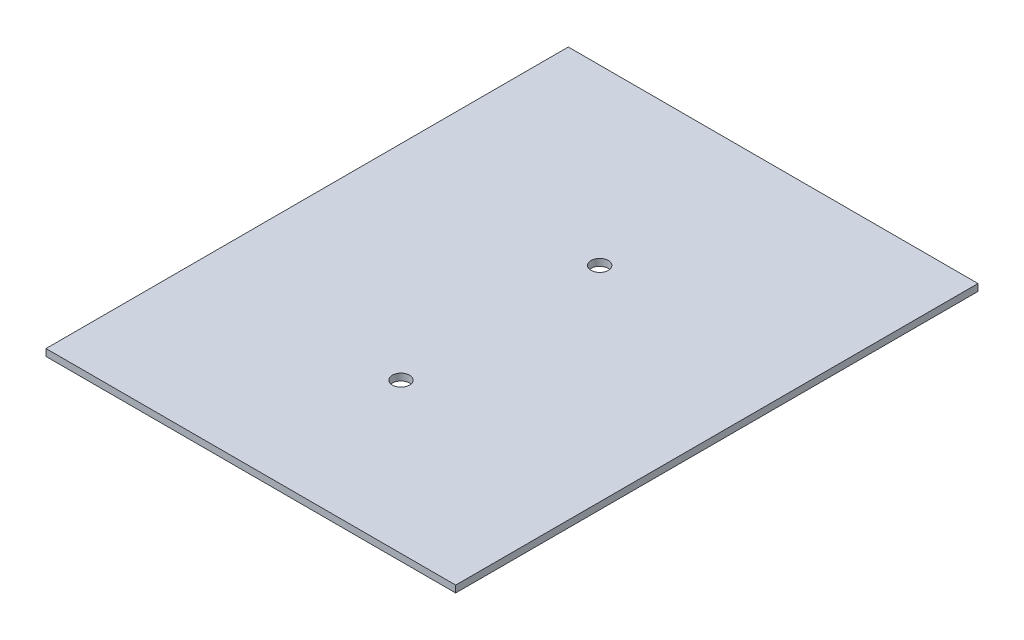
ISO-10303-21;
HEADER;
FILE_DESCRIPTION(('STEP AP214'),'2;1');
FILE_NAME('part.step','',(''),(''),'','','');
FILE_SCHEMA(('AUTOMOTIVE_DESIGN { 1 0 10303 214 1 1 1 1 }'));
ENDSEC;
DATA;
#1=APPLICATION_CONTEXT('core data for automotive mechanical design processes');
#2=APPLICATION_PROTOCOL_DEFINITION('international standard','automotive_design',2000,#1);
#3=PRODUCT_CONTEXT('',#1,'mechanical');
#4=PRODUCT('Part','Part','',(#3));
#5=PRODUCT_RELATED_PRODUCT_CATEGORY('part','',(#4));
#6=PRODUCT_DEFINITION_FORMATION('','',#4);
#7=PRODUCT_DEFINITION_CONTEXT('part definition',#1,'design');
#8=PRODUCT_DEFINITION('design','',#6,#7);
#9=PRODUCT_DEFINITION_SHAPE('','',#8);
#10=(LENGTH_UNIT() NAMED_UNIT(*) SI_UNIT(.MILLI.,.METRE.));
#11=(NAMED_UNIT(*) PLANE_ANGLE_UNIT() SI_UNIT($,.RADIAN.));
#12=(NAMED_UNIT(*) SI_UNIT($,.STERADIAN.) SOLID_ANGLE_UNIT());
#13=UNCERTAINTY_MEASURE_WITH_UNIT(LENGTH_MEASURE(1.E-05),#10,'distance_accuracy_value','');
#14=(GEOMETRIC_REPRESENTATION_CONTEXT(3) GLOBAL_UNCERTAINTY_ASSIGNED_CONTEXT((#13)) GLOBAL_UNIT_ASSIGNED_CONTEXT((#10,
#11,#12)) REPRESENTATION_CONTEXT('',''));
#15=CARTESIAN_POINT('',(0.,0.,0.));
#16=DIRECTION('',(0.,0.,1.));
#17=DIRECTION('',(1.,0.,0.));
#18=AXIS2_PLACEMENT_3D('',#15,#16,#17);
#19=CARTESIAN_POINT('',(0.,4.,0.));
#20=DIRECTION('',(0.,1.,0.));
#21=DIRECTION('',(0.,0.,1.));
#22=AXIS2_PLACEMENT_3D('',#19,#20,#21);
#23=PLANE('',#22);
#24=CARTESIAN_POINT('',(83.2878970718406,4.,-44.7356087323069));
#25=DIRECTION('',(0.,1.,0.));
#26=DIRECTION('',(0.,0.,1.));
#27=AXIS2_PLACEMENT_3D('',#24,#25,#26);
#28=CIRCLE('',#27,5.00000000000001);
#29=CARTESIAN_POINT('',(83.2878970718406,4.,-39.7356087323069));
#30=VERTEX_POINT('',#29);
#31=EDGE_CURVE('E100',#30,#30,#28,.T.);
#32=ORIENTED_EDGE('',*,*,#31,.F.);
#33=EDGE_LOOP('',(#32));
#34=FACE_BOUND('',#33,.T.);
#35=DIRECTION('',(0.,0.,1.));
#36=VECTOR('',#35,1.);
#37=CARTESIAN_POINT('',(-35.7607038797858,4.,-145.568524664055));
#38=LINE('',#37,#36);
#39=CARTESIAN_POINT('',(-35.7607038797858,4.,-145.568524664055));
#40=VERTEX_POINT('',#39);
#41=CARTESIAN_POINT('',(-35.7607038797858,4.,157.988862081275));
#42=VERTEX_POINT('',#41);
#43=EDGE_CURVE('E85',#40,#42,#38,.T.);
#44=ORIENTED_EDGE('',*,*,#43,.T.);
#45=DIRECTION('',(1.,0.,0.));
#46=VECTOR('',#45,1.);
#47=CARTESIAN_POINT('',(-35.7607038797858,4.,157.988862081275));
#48=LINE('',#47,#46);
#49=CARTESIAN_POINT('',(202.336498023467,4.,157.988862081275));
#50=VERTEX_POINT('',#49);
#51=EDGE_CURVE('E80',#42,#50,#48,.T.);
#52=ORIENTED_EDGE('',*,*,#51,.T.);
#53=DIRECTION('',(0.,0.,-1.));
#54=VECTOR('',#53,1.);
#55=CARTESIAN_POINT('',(202.336498023467,4.,-145.568524664055));
#56=LINE('',#55,#54);
#57=CARTESIAN_POINT('',(202.336498023467,4.,-145.568524664055));
#58=VERTEX_POINT('',#57);
#59=EDGE_CURVE('E83',#50,#58,#56,.T.);
#60=ORIENTED_EDGE('',*,*,#59,.T.);
#61=DIRECTION('',(-1.,0.,0.));
#62=VECTOR('',#61,1.);
#63=CARTESIAN_POINT('',(-35.7607038797858,4.,-145.568524664055));
#64=LINE('',#63,#62);
#65=EDGE_CURVE('E50',#58,#40,#64,.T.);
#66=ORIENTED_EDGE('',*,*,#65,.T.);
#67=EDGE_LOOP('',(#44,#52,#60,#66));
#68=FACE_BOUND('',#67,.T.);
#69=CARTESIAN_POINT('',(83.2878970718406,4.,70.7344451056182));
#70=DIRECTION('',(0.,1.,0.));
#71=DIRECTION('',(0.,0.,1.));
#72=AXIS2_PLACEMENT_3D('',#69,#70,#71);
#73=CIRCLE('',#72,5.00000000000001);
#74=CARTESIAN_POINT('',(83.2878970718406,4.,75.7344451056182));
#75=VERTEX_POINT('',#74);
#76=EDGE_CURVE('E115',#75,#75,#73,.T.);
#77=ORIENTED_EDGE('',*,*,#76,.F.);
#78=EDGE_LOOP('',(#77));
#79=FACE_BOUND('',#78,.T.);
#80=ADVANCED_FACE('F33',(#34,#68,#79),#23,.T.);
#81=CARTESIAN_POINT('',(0.,0.,0.));
#82=DIRECTION('',(0.,1.,0.));
#83=DIRECTION('',(0.,0.,1.));
#84=AXIS2_PLACEMENT_3D('',#81,#82,#83);
#85=PLANE('',#84);
#86=DIRECTION('',(0.,0.,1.));
#87=VECTOR('',#86,1.);
#88=CARTESIAN_POINT('',(-35.7607038797858,0.,-145.568524664055));
#89=LINE('',#88,#87);
#90=CARTESIAN_POINT('',(-35.7607038797858,0.,-145.568524664055));
#91=VERTEX_POINT('',#90);
#92=CARTESIAN_POINT('',(-35.7607038797858,0.,157.988862081275));
#93=VERTEX_POINT('',#92);
#94=EDGE_CURVE('E97',#91,#93,#89,.T.);
#95=ORIENTED_EDGE('',*,*,#94,.F.);
#96=DIRECTION('',(-1.,0.,0.));
#97=VECTOR('',#96,1.);
#98=CARTESIAN_POINT('',(-35.7607038797858,0.,-145.568524664055));
#99=LINE('',#98,#97);
#100=CARTESIAN_POINT('',(202.336498023467,0.,-145.568524664055));
#101=VERTEX_POINT('',#100);
#102=EDGE_CURVE('E73',#101,#91,#99,.T.);
#103=ORIENTED_EDGE('',*,*,#102,.F.);
#104=DIRECTION('',(0.,0.,-1.));
#105=VECTOR('',#104,1.);
#106=CARTESIAN_POINT('',(202.336498023467,0.,-145.568524664055));
#107=LINE('',#106,#105);
#108=CARTESIAN_POINT('',(202.336498023467,0.,157.988862081275));
#109=VERTEX_POINT('',#108);
#110=EDGE_CURVE('E67',#109,#101,#107,.T.);
#111=ORIENTED_EDGE('',*,*,#110,.F.);
#112=DIRECTION('',(1.,0.,0.));
#113=VECTOR('',#112,1.);
#114=CARTESIAN_POINT('',(-35.7607038797858,0.,157.988862081275));
#115=LINE('',#114,#113);
#116=EDGE_CURVE('E89',#93,#109,#115,.T.);
#117=ORIENTED_EDGE('',*,*,#116,.F.);
#118=EDGE_LOOP('',(#95,#103,#111,#117));
#119=FACE_BOUND('',#118,.T.);
#120=CARTESIAN_POINT('',(83.2878970718406,0.,-44.7356087323069));
#121=DIRECTION('',(0.,1.,0.));
#122=DIRECTION('',(0.,0.,1.));
#123=AXIS2_PLACEMENT_3D('',#120,#121,#122);
#124=CIRCLE('',#123,5.00000000000001);
#125=CARTESIAN_POINT('',(83.2878970718406,0.,-39.7356087323069));
#126=VERTEX_POINT('',#125);
#127=EDGE_CURVE('E112',#126,#126,#124,.T.);
#128=ORIENTED_EDGE('',*,*,#127,.T.);
#129=EDGE_LOOP('',(#128));
#130=FACE_BOUND('',#129,.T.);
#131=CARTESIAN_POINT('',(83.2878970718406,0.,70.7344451056182));
#132=DIRECTION('',(0.,1.,0.));
#133=DIRECTION('',(0.,0.,1.));
#134=AXIS2_PLACEMENT_3D('',#131,#132,#133);
#135=CIRCLE('',#134,5.00000000000001);
#136=CARTESIAN_POINT('',(83.2878970718406,0.,75.7344451056182));
#137=VERTEX_POINT('',#136);
#138=EDGE_CURVE('E118',#137,#137,#135,.T.);
#139=ORIENTED_EDGE('',*,*,#138,.T.);
#140=EDGE_LOOP('',(#139));
#141=FACE_BOUND('',#140,.T.);
#142=ADVANCED_FACE('F108',(#119,#130,#141),#85,.F.);
#143=CARTESIAN_POINT('',(-35.7607038797858,4.,-145.568524664055));
#144=DIRECTION('',(1.,0.,0.));
#145=DIRECTION('',(0.,0.,-1.));
#146=AXIS2_PLACEMENT_3D('',#143,#144,#145);
#147=PLANE('',#146);
#148=ORIENTED_EDGE('',*,*,#94,.T.);
#149=DIRECTION('',(0.,-1.,0.));
#150=VECTOR('',#149,1.);
#151=CARTESIAN_POINT('',(-35.7607038797858,4.,157.988862081275));
#152=LINE('',#151,#150);
#153=EDGE_CURVE('E11',#42,#93,#152,.T.);
#154=ORIENTED_EDGE('',*,*,#153,.F.);
#155=ORIENTED_EDGE('',*,*,#43,.F.);
#156=DIRECTION('',(0.,-1.,0.));
#157=VECTOR('',#156,1.);
#158=CARTESIAN_POINT('',(-35.7607038797858,4.,-145.568524664055));
#159=LINE('',#158,#157);
#160=EDGE_CURVE('E93',#40,#91,#159,.T.);
#161=ORIENTED_EDGE('',*,*,#160,.T.);
#162=EDGE_LOOP('',(#148,#154,#155,#161));
#163=FACE_BOUND('',#162,.T.);
#164=ADVANCED_FACE('F35',(#163),#147,.F.);
#165=CARTESIAN_POINT('',(-35.7607038797858,4.,157.988862081275));
#166=DIRECTION('',(0.,0.,-1.));
#167=DIRECTION('',(-1.,0.,0.));
#168=AXIS2_PLACEMENT_3D('',#165,#166,#167);
#169=PLANE('',#168);
#170=ORIENTED_EDGE('',*,*,#116,.T.);
#171=DIRECTION('',(0.,-1.,0.));
#172=VECTOR('',#171,1.);
#173=CARTESIAN_POINT('',(202.336498023467,4.,157.988862081275));
#174=LINE('',#173,#172);
#175=EDGE_CURVE('E42',#50,#109,#174,.T.);
#176=ORIENTED_EDGE('',*,*,#175,.F.);
#177=ORIENTED_EDGE('',*,*,#51,.F.);
#178=ORIENTED_EDGE('',*,*,#153,.T.);
#179=EDGE_LOOP('',(#170,#176,#177,#178));
#180=FACE_BOUND('',#179,.T.);
#181=ADVANCED_FACE('F88',(#180),#169,.F.);
#182=CARTESIAN_POINT('',(202.336498023467,4.,-145.568524664055));
#183=DIRECTION('',(-1.,0.,0.));
#184=DIRECTION('',(0.,0.,1.));
#185=AXIS2_PLACEMENT_3D('',#182,#183,#184);
#186=PLANE('',#185);
#187=ORIENTED_EDGE('',*,*,#110,.T.);
#188=DIRECTION('',(0.,-1.,0.));
#189=VECTOR('',#188,1.);
#190=CARTESIAN_POINT('',(202.336498023467,4.,-145.568524664055));
#191=LINE('',#190,#189);
#192=EDGE_CURVE('E90',#58,#101,#191,.T.);
#193=ORIENTED_EDGE('',*,*,#192,.F.);
#194=ORIENTED_EDGE('',*,*,#59,.F.);
#195=ORIENTED_EDGE('',*,*,#175,.T.);
#196=EDGE_LOOP('',(#187,#193,#194,#195));
#197=FACE_BOUND('',#196,.T.);
#198=ADVANCED_FACE('F91',(#197),#186,.F.);
#199=CARTESIAN_POINT('',(-35.7607038797858,4.,-145.568524664055));
#200=DIRECTION('',(0.,0.,1.));
#201=DIRECTION('',(1.,0.,0.));
#202=AXIS2_PLACEMENT_3D('',#199,#200,#201);
#203=PLANE('',#202);
#204=ORIENTED_EDGE('',*,*,#102,.T.);
#205=ORIENTED_EDGE('',*,*,#160,.F.);
#206=ORIENTED_EDGE('',*,*,#65,.F.);
#207=ORIENTED_EDGE('',*,*,#192,.T.);
#208=EDGE_LOOP('',(#204,#205,#206,#207));
#209=FACE_BOUND('',#208,.T.);
#210=ADVANCED_FACE('F105',(#209),#203,.F.);
#211=CARTESIAN_POINT('',(83.2878970718406,4.,-44.7356087323069));
#212=DIRECTION('',(0.,-1.,0.));
#213=DIRECTION('',(0.,0.,-1.));
#214=AXIS2_PLACEMENT_3D('',#211,#212,#213);
#215=CYLINDRICAL_SURFACE('',#214,5.00000000000001);
#216=ORIENTED_EDGE('',*,*,#31,.T.);
#217=EDGE_LOOP('',(#216));
#218=FACE_BOUND('',#217,.T.);
#219=ORIENTED_EDGE('',*,*,#127,.F.);
#220=EDGE_LOOP('',(#219));
#221=FACE_BOUND('',#220,.T.);
#222=ADVANCED_FACE('F135',(#218,#221),#215,.F.);
#223=CARTESIAN_POINT('',(83.2878970718406,4.,70.7344451056182));
#224=DIRECTION('',(0.,-1.,0.));
#225=DIRECTION('',(0.,0.,-1.));
#226=AXIS2_PLACEMENT_3D('',#223,#224,#225);
#227=CYLINDRICAL_SURFACE('',#226,5.00000000000001);
#228=ORIENTED_EDGE('',*,*,#76,.T.);
#229=EDGE_LOOP('',(#228));
#230=FACE_BOUND('',#229,.T.);
#231=ORIENTED_EDGE('',*,*,#138,.F.);
#232=EDGE_LOOP('',(#231));
#233=FACE_BOUND('',#232,.T.);
#234=ADVANCED_FACE('F124',(#230,#233),#227,.F.);
#235=CLOSED_SHELL('',(#80,#142,#164,#181,#198,#210,#222,#234));
#236=MANIFOLD_SOLID_BREP('B2',#235);
#237=ADVANCED_BREP_SHAPE_REPRESENTATION('',(#18,#236),#14);
#238=SHAPE_DEFINITION_REPRESENTATION(#9,#237);
ENDSEC;
END-ISO-10303-21;
